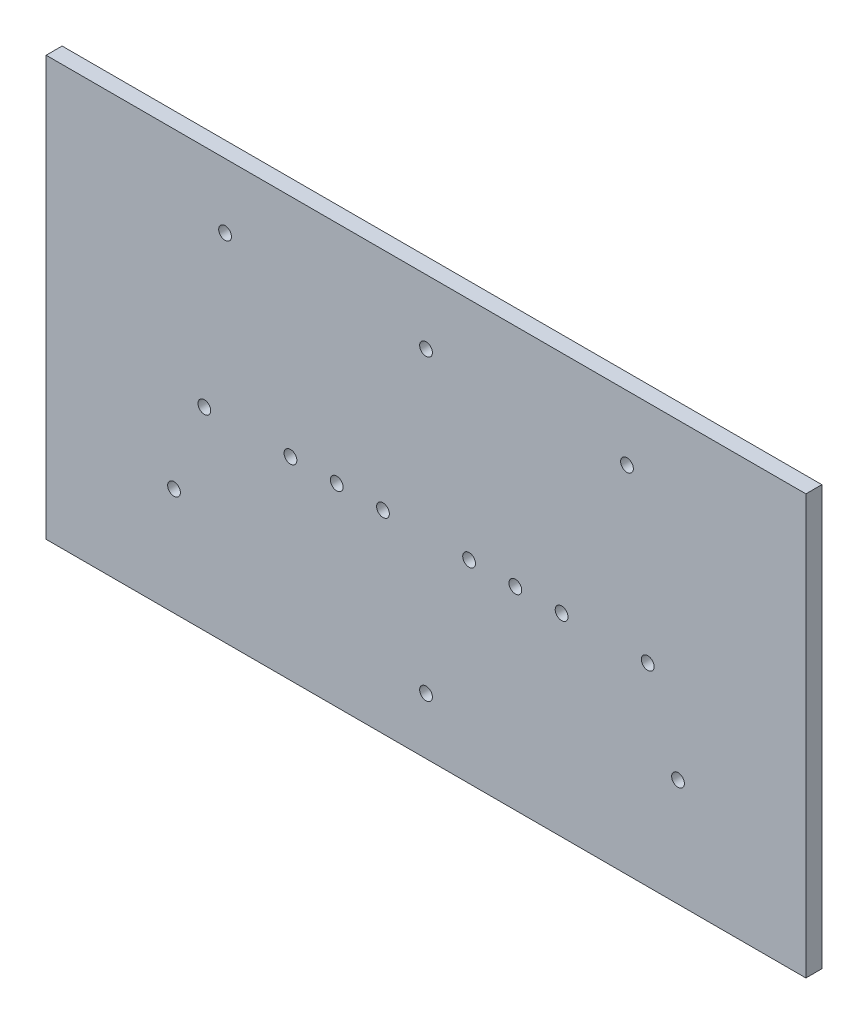
ISO-10303-21;
HEADER;
FILE_DESCRIPTION(('STEP AP214'),'2;1');
FILE_NAME('part.step','',(''),(''),'','','');
FILE_SCHEMA(('AUTOMOTIVE_DESIGN { 1 0 10303 214 1 1 1 1 }'));
ENDSEC;
DATA;
#1=APPLICATION_CONTEXT('core data for automotive mechanical design processes');
#2=APPLICATION_PROTOCOL_DEFINITION('international standard','automotive_design',2000,#1);
#3=PRODUCT_CONTEXT('',#1,'mechanical');
#4=PRODUCT('Part','Part','',(#3));
#5=PRODUCT_RELATED_PRODUCT_CATEGORY('part','',(#4));
#6=PRODUCT_DEFINITION_FORMATION('','',#4);
#7=PRODUCT_DEFINITION_CONTEXT('part definition',#1,'design');
#8=PRODUCT_DEFINITION('design','',#6,#7);
#9=PRODUCT_DEFINITION_SHAPE('','',#8);
#10=(LENGTH_UNIT() NAMED_UNIT(*) SI_UNIT(.MILLI.,.METRE.));
#11=(NAMED_UNIT(*) PLANE_ANGLE_UNIT() SI_UNIT($,.RADIAN.));
#12=(NAMED_UNIT(*) SI_UNIT($,.STERADIAN.) SOLID_ANGLE_UNIT());
#13=UNCERTAINTY_MEASURE_WITH_UNIT(LENGTH_MEASURE(1.E-05),#10,'distance_accuracy_value','');
#14=(GEOMETRIC_REPRESENTATION_CONTEXT(3) GLOBAL_UNCERTAINTY_ASSIGNED_CONTEXT((#13)) GLOBAL_UNIT_ASSIGNED_CONTEXT((#10,
#11,#12)) REPRESENTATION_CONTEXT('',''));
#15=CARTESIAN_POINT('',(0.,0.,0.));
#16=DIRECTION('',(0.,0.,1.));
#17=DIRECTION('',(1.,0.,0.));
#18=AXIS2_PLACEMENT_3D('',#15,#16,#17);
#19=CARTESIAN_POINT('',(0.,0.,0.));
#20=DIRECTION('',(0.,0.,1.));
#21=DIRECTION('',(1.,0.,0.));
#22=AXIS2_PLACEMENT_3D('',#19,#20,#21);
#23=PLANE('',#22);
#24=DIRECTION('',(-1.,0.,0.));
#25=VECTOR('',#24,1.);
#26=CARTESIAN_POINT('',(0.,65.7214488355136,0.));
#27=LINE('',#26,#25);
#28=CARTESIAN_POINT('',(119.089576198768,65.7214488355136,0.));
#29=VERTEX_POINT('',#28);
#30=CARTESIAN_POINT('',(-119.089576198768,65.7214488355136,0.));
#31=VERTEX_POINT('',#30);
#32=EDGE_CURVE('E406',#29,#31,#27,.T.);
#33=ORIENTED_EDGE('',*,*,#32,.F.);
#34=DIRECTION('',(0.,-1.,0.));
#35=VECTOR('',#34,1.);
#36=CARTESIAN_POINT('',(119.089576198768,0.,0.));
#37=LINE('',#36,#35);
#38=CARTESIAN_POINT('',(119.089576198768,-65.7214488355136,0.));
#39=VERTEX_POINT('',#38);
#40=EDGE_CURVE('E314',#29,#39,#37,.T.);
#41=ORIENTED_EDGE('',*,*,#40,.T.);
#42=DIRECTION('',(-1.,0.,0.));
#43=VECTOR('',#42,1.);
#44=CARTESIAN_POINT('',(0.,-65.7214488355136,0.));
#45=LINE('',#44,#43);
#46=CARTESIAN_POINT('',(-119.089576198768,-65.7214488355136,0.));
#47=VERTEX_POINT('',#46);
#48=EDGE_CURVE('E412',#39,#47,#45,.T.);
#49=ORIENTED_EDGE('',*,*,#48,.T.);
#50=DIRECTION('',(0.,-1.,0.));
#51=VECTOR('',#50,1.);
#52=CARTESIAN_POINT('',(-119.089576198768,0.,0.));
#53=LINE('',#52,#51);
#54=EDGE_CURVE('E409',#31,#47,#53,.T.);
#55=ORIENTED_EDGE('',*,*,#54,.F.);
#56=EDGE_LOOP('',(#33,#41,#49,#55));
#57=FACE_BOUND('',#56,.T.);
#58=DIRECTION('',(0.,-1.,0.));
#59=VECTOR('',#58,1.);
#60=CARTESIAN_POINT('',(91.,0.,0.));
#61=LINE('',#60,#59);
#62=CARTESIAN_POINT('',(91.,35.,0.));
#63=VERTEX_POINT('',#62);
#64=CARTESIAN_POINT('',(91.,-35.,0.));
#65=VERTEX_POINT('',#64);
#66=EDGE_CURVE('E257',#63,#65,#61,.T.);
#67=ORIENTED_EDGE('',*,*,#66,.F.);
#68=CARTESIAN_POINT('',(69.,35.,0.));
#69=DIRECTION('',(0.,0.,1.));
#70=DIRECTION('',(1.,0.,0.));
#71=AXIS2_PLACEMENT_3D('',#68,#69,#70);
#72=CIRCLE('',#71,22.);
#73=CARTESIAN_POINT('',(69.,57.,0.));
#74=VERTEX_POINT('',#73);
#75=EDGE_CURVE('E52',#74,#63,#72,.F.);
#76=ORIENTED_EDGE('',*,*,#75,.F.);
#77=DIRECTION('',(-1.,0.,0.));
#78=VECTOR('',#77,1.);
#79=CARTESIAN_POINT('',(0.,57.,0.));
#80=LINE('',#79,#78);
#81=CARTESIAN_POINT('',(-69.,57.,0.));
#82=VERTEX_POINT('',#81);
#83=EDGE_CURVE('E179',#74,#82,#80,.T.);
#84=ORIENTED_EDGE('',*,*,#83,.T.);
#85=CARTESIAN_POINT('',(-69.,35.,0.));
#86=DIRECTION('',(0.,0.,1.));
#87=DIRECTION('',(1.,0.,0.));
#88=AXIS2_PLACEMENT_3D('',#85,#86,#87);
#89=CIRCLE('',#88,22.);
#90=CARTESIAN_POINT('',(-91.,35.,0.));
#91=VERTEX_POINT('',#90);
#92=EDGE_CURVE('E242',#82,#91,#89,.T.);
#93=ORIENTED_EDGE('',*,*,#92,.T.);
#94=DIRECTION('',(0.,-1.,0.));
#95=VECTOR('',#94,1.);
#96=CARTESIAN_POINT('',(-91.,0.,0.));
#97=LINE('',#96,#95);
#98=CARTESIAN_POINT('',(-91.,-35.,0.));
#99=VERTEX_POINT('',#98);
#100=EDGE_CURVE('E245',#91,#99,#97,.T.);
#101=ORIENTED_EDGE('',*,*,#100,.T.);
#102=CARTESIAN_POINT('',(-69.,-35.,0.));
#103=DIRECTION('',(0.,0.,1.));
#104=DIRECTION('',(1.,0.,0.));
#105=AXIS2_PLACEMENT_3D('',#102,#103,#104);
#106=CIRCLE('',#105,22.);
#107=CARTESIAN_POINT('',(-69.,-57.,0.));
#108=VERTEX_POINT('',#107);
#109=EDGE_CURVE('E248',#108,#99,#106,.F.);
#110=ORIENTED_EDGE('',*,*,#109,.F.);
#111=DIRECTION('',(-1.,0.,0.));
#112=VECTOR('',#111,1.);
#113=CARTESIAN_POINT('',(0.,-57.,0.));
#114=LINE('',#113,#112);
#115=CARTESIAN_POINT('',(69.,-57.,0.));
#116=VERTEX_POINT('',#115);
#117=EDGE_CURVE('E251',#116,#108,#114,.T.);
#118=ORIENTED_EDGE('',*,*,#117,.F.);
#119=CARTESIAN_POINT('',(69.,-35.,0.));
#120=DIRECTION('',(0.,0.,1.));
#121=DIRECTION('',(1.,0.,0.));
#122=AXIS2_PLACEMENT_3D('',#119,#120,#121);
#123=CIRCLE('',#122,22.);
#124=EDGE_CURVE('E254',#65,#116,#123,.F.);
#125=ORIENTED_EDGE('',*,*,#124,.F.);
#126=EDGE_LOOP('',(#67,#76,#84,#93,#101,#110,#118,#125));
#127=FACE_BOUND('',#126,.T.);
#128=ADVANCED_FACE('F37',(#57,#127),#23,.F.);
#129=CARTESIAN_POINT('',(-28.,-5.00000000000001,0.));
#130=DIRECTION('',(0.,0.,1.));
#131=DIRECTION('',(1.,0.,0.));
#132=AXIS2_PLACEMENT_3D('',#129,#130,#131);
#133=CIRCLE('',#132,2.);
#134=CARTESIAN_POINT('',(-26.,-5.00000000000001,0.));
#135=VERTEX_POINT('',#134);
#136=EDGE_CURVE('E403',#135,#135,#133,.T.);
#137=ORIENTED_EDGE('',*,*,#136,.T.);
#138=EDGE_LOOP('',(#137));
#139=FACE_BOUND('',#138,.T.);
#140=CARTESIAN_POINT('',(0.,45.500000000002,0.));
#141=DIRECTION('',(0.,0.,1.));
#142=DIRECTION('',(1.,0.,0.));
#143=AXIS2_PLACEMENT_3D('',#140,#141,#142);
#144=CIRCLE('',#143,2.);
#145=CARTESIAN_POINT('',(2.,45.500000000002,0.));
#146=VERTEX_POINT('',#145);
#147=EDGE_CURVE('E400',#146,#146,#144,.T.);
#148=ORIENTED_EDGE('',*,*,#147,.T.);
#149=EDGE_LOOP('',(#148));
#150=FACE_BOUND('',#149,.T.);
#151=CARTESIAN_POINT('',(69.5,-5.00000000000001,0.));
#152=DIRECTION('',(0.,0.,1.));
#153=DIRECTION('',(1.,0.,0.));
#154=AXIS2_PLACEMENT_3D('',#151,#152,#153);
#155=CIRCLE('',#154,2.);
#156=CARTESIAN_POINT('',(71.5,-5.00000000000001,0.));
#157=VERTEX_POINT('',#156);
#158=EDGE_CURVE('E397',#157,#157,#155,.T.);
#159=ORIENTED_EDGE('',*,*,#158,.T.);
#160=EDGE_LOOP('',(#159));
#161=FACE_BOUND('',#160,.T.);
#162=CARTESIAN_POINT('',(42.5,-5.,0.));
#163=DIRECTION('',(0.,0.,1.));
#164=DIRECTION('',(1.,0.,0.));
#165=AXIS2_PLACEMENT_3D('',#162,#163,#164);
#166=CIRCLE('',#165,2.);
#167=CARTESIAN_POINT('',(44.5,-5.,0.));
#168=VERTEX_POINT('',#167);
#169=EDGE_CURVE('E394',#168,#168,#166,.T.);
#170=ORIENTED_EDGE('',*,*,#169,.T.);
#171=EDGE_LOOP('',(#170));
#172=FACE_BOUND('',#171,.T.);
#173=CARTESIAN_POINT('',(28.,-5.00000000000001,0.));
#174=DIRECTION('',(0.,0.,1.));
#175=DIRECTION('',(1.,0.,0.));
#176=AXIS2_PLACEMENT_3D('',#173,#174,#175);
#177=CIRCLE('',#176,2.);
#178=CARTESIAN_POINT('',(30.,-5.00000000000001,0.));
#179=VERTEX_POINT('',#178);
#180=EDGE_CURVE('E391',#179,#179,#177,.T.);
#181=ORIENTED_EDGE('',*,*,#180,.T.);
#182=EDGE_LOOP('',(#181));
#183=FACE_BOUND('',#182,.T.);
#184=CARTESIAN_POINT('',(13.5,-5.00000000000001,0.));
#185=DIRECTION('',(0.,0.,1.));
#186=DIRECTION('',(1.,0.,0.));
#187=AXIS2_PLACEMENT_3D('',#184,#185,#186);
#188=CIRCLE('',#187,2.);
#189=CARTESIAN_POINT('',(15.5,-5.00000000000001,0.));
#190=VERTEX_POINT('',#189);
#191=EDGE_CURVE('E388',#190,#190,#188,.T.);
#192=ORIENTED_EDGE('',*,*,#191,.T.);
#193=EDGE_LOOP('',(#192));
#194=FACE_BOUND('',#193,.T.);
#195=CARTESIAN_POINT('',(-13.5,-5.00000000000001,0.));
#196=DIRECTION('',(0.,0.,1.));
#197=DIRECTION('',(1.,0.,0.));
#198=AXIS2_PLACEMENT_3D('',#195,#196,#197);
#199=CIRCLE('',#198,2.);
#200=CARTESIAN_POINT('',(-11.5,-5.00000000000001,0.));
#201=VERTEX_POINT('',#200);
#202=EDGE_CURVE('E385',#201,#201,#199,.T.);
#203=ORIENTED_EDGE('',*,*,#202,.T.);
#204=EDGE_LOOP('',(#203));
#205=FACE_BOUND('',#204,.T.);
#206=CARTESIAN_POINT('',(-79.,-32.,0.));
#207=DIRECTION('',(0.,0.,1.));
#208=DIRECTION('',(1.,0.,0.));
#209=AXIS2_PLACEMENT_3D('',#206,#207,#208);
#210=CIRCLE('',#209,2.);
#211=CARTESIAN_POINT('',(-77.,-32.,0.));
#212=VERTEX_POINT('',#211);
#213=EDGE_CURVE('E382',#212,#212,#210,.T.);
#214=ORIENTED_EDGE('',*,*,#213,.T.);
#215=EDGE_LOOP('',(#214));
#216=FACE_BOUND('',#215,.T.);
#217=CARTESIAN_POINT('',(-69.5,-5.00000000000001,0.));
#218=DIRECTION('',(0.,0.,1.));
#219=DIRECTION('',(1.,0.,0.));
#220=AXIS2_PLACEMENT_3D('',#217,#218,#219);
#221=CIRCLE('',#220,2.);
#222=CARTESIAN_POINT('',(-67.5,-5.00000000000001,0.));
#223=VERTEX_POINT('',#222);
#224=EDGE_CURVE('E379',#223,#223,#221,.T.);
#225=ORIENTED_EDGE('',*,*,#224,.T.);
#226=EDGE_LOOP('',(#225));
#227=FACE_BOUND('',#226,.T.);
#228=CARTESIAN_POINT('',(-42.5,-5.00000000000001,0.));
#229=DIRECTION('',(0.,0.,1.));
#230=DIRECTION('',(1.,0.,0.));
#231=AXIS2_PLACEMENT_3D('',#228,#229,#230);
#232=CIRCLE('',#231,2.);
#233=CARTESIAN_POINT('',(-40.5,-5.00000000000001,0.));
#234=VERTEX_POINT('',#233);
#235=EDGE_CURVE('E376',#234,#234,#232,.T.);
#236=ORIENTED_EDGE('',*,*,#235,.T.);
#237=EDGE_LOOP('',(#236));
#238=FACE_BOUND('',#237,.T.);
#239=CARTESIAN_POINT('',(-63.,45.5,0.));
#240=DIRECTION('',(0.,0.,1.));
#241=DIRECTION('',(1.,0.,0.));
#242=AXIS2_PLACEMENT_3D('',#239,#240,#241);
#243=CIRCLE('',#242,2.);
#244=CARTESIAN_POINT('',(-61.,45.5,0.));
#245=VERTEX_POINT('',#244);
#246=EDGE_CURVE('E373',#245,#245,#243,.T.);
#247=ORIENTED_EDGE('',*,*,#246,.T.);
#248=EDGE_LOOP('',(#247));
#249=FACE_BOUND('',#248,.T.);
#250=CARTESIAN_POINT('',(63.,45.5,0.));
#251=DIRECTION('',(0.,0.,1.));
#252=DIRECTION('',(1.,0.,0.));
#253=AXIS2_PLACEMENT_3D('',#250,#251,#252);
#254=CIRCLE('',#253,2.);
#255=CARTESIAN_POINT('',(65.,45.5,0.));
#256=VERTEX_POINT('',#255);
#257=EDGE_CURVE('E370',#256,#256,#254,.T.);
#258=ORIENTED_EDGE('',*,*,#257,.T.);
#259=EDGE_LOOP('',(#258));
#260=FACE_BOUND('',#259,.T.);
#261=CARTESIAN_POINT('',(0.,-48.,0.));
#262=DIRECTION('',(0.,0.,1.));
#263=DIRECTION('',(1.,0.,0.));
#264=AXIS2_PLACEMENT_3D('',#261,#262,#263);
#265=CIRCLE('',#264,2.);
#266=CARTESIAN_POINT('',(1.99999999999999,-48.,0.));
#267=VERTEX_POINT('',#266);
#268=EDGE_CURVE('E367',#267,#267,#265,.T.);
#269=ORIENTED_EDGE('',*,*,#268,.T.);
#270=EDGE_LOOP('',(#269));
#271=FACE_BOUND('',#270,.T.);
#272=CARTESIAN_POINT('',(79.,-32.,0.));
#273=DIRECTION('',(0.,0.,1.));
#274=DIRECTION('',(1.,0.,0.));
#275=AXIS2_PLACEMENT_3D('',#272,#273,#274);
#276=CIRCLE('',#275,2.);
#277=CARTESIAN_POINT('',(81.,-32.,0.));
#278=VERTEX_POINT('',#277);
#279=EDGE_CURVE('E297',#278,#278,#276,.T.);
#280=ORIENTED_EDGE('',*,*,#279,.T.);
#281=EDGE_LOOP('',(#280));
#282=FACE_BOUND('',#281,.T.);
#283=CARTESIAN_POINT('',(-69.,35.,0.));
#284=DIRECTION('',(0.,0.,1.));
#285=DIRECTION('',(1.,0.,0.));
#286=AXIS2_PLACEMENT_3D('',#283,#284,#285);
#287=CIRCLE('',#286,20.);
#288=CARTESIAN_POINT('',(-69.,55.,0.));
#289=VERTEX_POINT('',#288);
#290=CARTESIAN_POINT('',(-89.,35.,0.));
#291=VERTEX_POINT('',#290);
#292=EDGE_CURVE('E197',#289,#291,#287,.T.);
#293=ORIENTED_EDGE('',*,*,#292,.F.);
#294=DIRECTION('',(-1.,0.,0.));
#295=VECTOR('',#294,1.);
#296=CARTESIAN_POINT('',(0.,55.,0.));
#297=LINE('',#296,#295);
#298=CARTESIAN_POINT('',(69.,55.,0.));
#299=VERTEX_POINT('',#298);
#300=EDGE_CURVE('E60',#299,#289,#297,.T.);
#301=ORIENTED_EDGE('',*,*,#300,.F.);
#302=CARTESIAN_POINT('',(69.,35.,0.));
#303=DIRECTION('',(0.,0.,1.));
#304=DIRECTION('',(1.,0.,0.));
#305=AXIS2_PLACEMENT_3D('',#302,#303,#304);
#306=CIRCLE('',#305,20.);
#307=CARTESIAN_POINT('',(89.,35.,0.));
#308=VERTEX_POINT('',#307);
#309=EDGE_CURVE('E261',#299,#308,#306,.F.);
#310=ORIENTED_EDGE('',*,*,#309,.T.);
#311=DIRECTION('',(0.,-1.,0.));
#312=VECTOR('',#311,1.);
#313=CARTESIAN_POINT('',(89.,0.,0.));
#314=LINE('',#313,#312);
#315=CARTESIAN_POINT('',(89.,-35.,0.));
#316=VERTEX_POINT('',#315);
#317=EDGE_CURVE('E264',#308,#316,#314,.T.);
#318=ORIENTED_EDGE('',*,*,#317,.T.);
#319=CARTESIAN_POINT('',(69.,-35.,0.));
#320=DIRECTION('',(0.,0.,1.));
#321=DIRECTION('',(1.,0.,0.));
#322=AXIS2_PLACEMENT_3D('',#319,#320,#321);
#323=CIRCLE('',#322,20.);
#324=CARTESIAN_POINT('',(69.,-55.,0.));
#325=VERTEX_POINT('',#324);
#326=EDGE_CURVE('E267',#316,#325,#323,.F.);
#327=ORIENTED_EDGE('',*,*,#326,.T.);
#328=DIRECTION('',(-1.,0.,0.));
#329=VECTOR('',#328,1.);
#330=CARTESIAN_POINT('',(0.,-55.,0.));
#331=LINE('',#330,#329);
#332=CARTESIAN_POINT('',(-69.,-55.,0.));
#333=VERTEX_POINT('',#332);
#334=EDGE_CURVE('E270',#325,#333,#331,.T.);
#335=ORIENTED_EDGE('',*,*,#334,.T.);
#336=CARTESIAN_POINT('',(-69.,-35.,0.));
#337=DIRECTION('',(0.,0.,1.));
#338=DIRECTION('',(1.,0.,0.));
#339=AXIS2_PLACEMENT_3D('',#336,#337,#338);
#340=CIRCLE('',#339,20.);
#341=CARTESIAN_POINT('',(-89.,-35.,0.));
#342=VERTEX_POINT('',#341);
#343=EDGE_CURVE('E273',#333,#342,#340,.F.);
#344=ORIENTED_EDGE('',*,*,#343,.T.);
#345=DIRECTION('',(0.,-1.,0.));
#346=VECTOR('',#345,1.);
#347=CARTESIAN_POINT('',(-89.,0.,0.));
#348=LINE('',#347,#346);
#349=EDGE_CURVE('E200',#291,#342,#348,.T.);
#350=ORIENTED_EDGE('',*,*,#349,.F.);
#351=EDGE_LOOP('',(#293,#301,#310,#318,#327,#335,#344,#350));
#352=FACE_BOUND('',#351,.T.);
#353=ADVANCED_FACE('F440',(#139,#150,#161,#172,#183,#194,#205,#216,#227,#238,#249,#260,#271,
#282,#352),#23,.F.);
#354=CARTESIAN_POINT('',(0.,65.7214488355136,5.));
#355=DIRECTION('',(0.,-1.,0.));
#356=DIRECTION('',(0.,0.,-1.));
#357=AXIS2_PLACEMENT_3D('',#354,#355,#356);
#358=PLANE('',#357);
#359=ORIENTED_EDGE('',*,*,#32,.T.);
#360=DIRECTION('',(0.,0.,-1.));
#361=VECTOR('',#360,1.);
#362=CARTESIAN_POINT('',(-119.089576198768,65.7214488355136,5.));
#363=LINE('',#362,#361);
#364=CARTESIAN_POINT('',(-119.089576198768,65.7214488355136,5.));
#365=VERTEX_POINT('',#364);
#366=EDGE_CURVE('E11',#365,#31,#363,.T.);
#367=ORIENTED_EDGE('',*,*,#366,.F.);
#368=DIRECTION('',(-1.,0.,0.));
#369=VECTOR('',#368,1.);
#370=CARTESIAN_POINT('',(0.,65.7214488355136,5.));
#371=LINE('',#370,#369);
#372=CARTESIAN_POINT('',(119.089576198768,65.7214488355136,5.));
#373=VERTEX_POINT('',#372);
#374=EDGE_CURVE('E353',#373,#365,#371,.T.);
#375=ORIENTED_EDGE('',*,*,#374,.F.);
#376=DIRECTION('',(0.,0.,-1.));
#377=VECTOR('',#376,1.);
#378=CARTESIAN_POINT('',(119.089576198768,65.7214488355136,5.));
#379=LINE('',#378,#377);
#380=EDGE_CURVE('E364',#373,#29,#379,.T.);
#381=ORIENTED_EDGE('',*,*,#380,.T.);
#382=EDGE_LOOP('',(#359,#367,#375,#381));
#383=FACE_BOUND('',#382,.T.);
#384=ADVANCED_FACE('F438',(#383),#358,.F.);
#385=CARTESIAN_POINT('',(-119.089576198768,0.,5.));
#386=DIRECTION('',(1.,0.,0.));
#387=DIRECTION('',(0.,0.,-1.));
#388=AXIS2_PLACEMENT_3D('',#385,#386,#387);
#389=PLANE('',#388);
#390=ORIENTED_EDGE('',*,*,#54,.T.);
#391=DIRECTION('',(0.,0.,-1.));
#392=VECTOR('',#391,1.);
#393=CARTESIAN_POINT('',(-119.089576198768,-65.7214488355136,5.));
#394=LINE('',#393,#392);
#395=CARTESIAN_POINT('',(-119.089576198768,-65.7214488355136,5.));
#396=VERTEX_POINT('',#395);
#397=EDGE_CURVE('E45',#396,#47,#394,.T.);
#398=ORIENTED_EDGE('',*,*,#397,.F.);
#399=DIRECTION('',(0.,-1.,0.));
#400=VECTOR('',#399,1.);
#401=CARTESIAN_POINT('',(-119.089576198768,0.,5.));
#402=LINE('',#401,#400);
#403=EDGE_CURVE('E356',#365,#396,#402,.T.);
#404=ORIENTED_EDGE('',*,*,#403,.F.);
#405=ORIENTED_EDGE('',*,*,#366,.T.);
#406=EDGE_LOOP('',(#390,#398,#404,#405));
#407=FACE_BOUND('',#406,.T.);
#408=ADVANCED_FACE('F425',(#407),#389,.F.);
#409=CARTESIAN_POINT('',(0.,-65.7214488355136,5.));
#410=DIRECTION('',(0.,-1.,0.));
#411=DIRECTION('',(0.,0.,-1.));
#412=AXIS2_PLACEMENT_3D('',#409,#410,#411);
#413=PLANE('',#412);
#414=ORIENTED_EDGE('',*,*,#48,.F.);
#415=DIRECTION('',(0.,0.,-1.));
#416=VECTOR('',#415,1.);
#417=CARTESIAN_POINT('',(119.089576198768,-65.7214488355136,5.));
#418=LINE('',#417,#416);
#419=CARTESIAN_POINT('',(119.089576198768,-65.7214488355136,5.));
#420=VERTEX_POINT('',#419);
#421=EDGE_CURVE('E418',#420,#39,#418,.T.);
#422=ORIENTED_EDGE('',*,*,#421,.F.);
#423=DIRECTION('',(-1.,0.,0.));
#424=VECTOR('',#423,1.);
#425=CARTESIAN_POINT('',(0.,-65.7214488355136,5.));
#426=LINE('',#425,#424);
#427=EDGE_CURVE('E358',#420,#396,#426,.T.);
#428=ORIENTED_EDGE('',*,*,#427,.T.);
#429=ORIENTED_EDGE('',*,*,#397,.T.);
#430=EDGE_LOOP('',(#414,#422,#428,#429));
#431=FACE_BOUND('',#430,.T.);
#432=ADVANCED_FACE('F422',(#431),#413,.T.);
#433=CARTESIAN_POINT('',(-28.,-5.00000000000001,5.));
#434=DIRECTION('',(0.,0.,-1.));
#435=DIRECTION('',(-1.,0.,0.));
#436=AXIS2_PLACEMENT_3D('',#433,#434,#435);
#437=CYLINDRICAL_SURFACE('',#436,2.);
#438=CARTESIAN_POINT('',(-28.,-5.00000000000001,5.));
#439=DIRECTION('',(0.,0.,1.));
#440=DIRECTION('',(1.,0.,0.));
#441=AXIS2_PLACEMENT_3D('',#438,#439,#440);
#442=CIRCLE('',#441,2.);
#443=CARTESIAN_POINT('',(-26.,-5.00000000000001,5.));
#444=VERTEX_POINT('',#443);
#445=EDGE_CURVE('E350',#444,#444,#442,.T.);
#446=ORIENTED_EDGE('',*,*,#445,.T.);
#447=EDGE_LOOP('',(#446));
#448=FACE_BOUND('',#447,.T.);
#449=ORIENTED_EDGE('',*,*,#136,.F.);
#450=EDGE_LOOP('',(#449));
#451=FACE_BOUND('',#450,.T.);
#452=ADVANCED_FACE('F459',(#448,#451),#437,.F.);
#453=CARTESIAN_POINT('',(0.,45.500000000002,5.));
#454=DIRECTION('',(0.,0.,-1.));
#455=DIRECTION('',(-1.,0.,0.));
#456=AXIS2_PLACEMENT_3D('',#453,#454,#455);
#457=CYLINDRICAL_SURFACE('',#456,2.);
#458=CARTESIAN_POINT('',(0.,45.500000000002,5.));
#459=DIRECTION('',(0.,0.,1.));
#460=DIRECTION('',(1.,0.,0.));
#461=AXIS2_PLACEMENT_3D('',#458,#459,#460);
#462=CIRCLE('',#461,2.);
#463=CARTESIAN_POINT('',(2.,45.500000000002,5.));
#464=VERTEX_POINT('',#463);
#465=EDGE_CURVE('E347',#464,#464,#462,.T.);
#466=ORIENTED_EDGE('',*,*,#465,.T.);
#467=EDGE_LOOP('',(#466));
#468=FACE_BOUND('',#467,.T.);
#469=ORIENTED_EDGE('',*,*,#147,.F.);
#470=EDGE_LOOP('',(#469));
#471=FACE_BOUND('',#470,.T.);
#472=ADVANCED_FACE('F463',(#468,#471),#457,.F.);
#473=CARTESIAN_POINT('',(69.5,-5.00000000000001,5.));
#474=DIRECTION('',(0.,0.,-1.));
#475=DIRECTION('',(-1.,0.,0.));
#476=AXIS2_PLACEMENT_3D('',#473,#474,#475);
#477=CYLINDRICAL_SURFACE('',#476,2.);
#478=CARTESIAN_POINT('',(69.5,-5.00000000000001,5.));
#479=DIRECTION('',(0.,0.,1.));
#480=DIRECTION('',(1.,0.,0.));
#481=AXIS2_PLACEMENT_3D('',#478,#479,#480);
#482=CIRCLE('',#481,2.);
#483=CARTESIAN_POINT('',(71.5,-5.00000000000001,5.));
#484=VERTEX_POINT('',#483);
#485=EDGE_CURVE('E344',#484,#484,#482,.T.);
#486=ORIENTED_EDGE('',*,*,#485,.T.);
#487=EDGE_LOOP('',(#486));
#488=FACE_BOUND('',#487,.T.);
#489=ORIENTED_EDGE('',*,*,#158,.F.);
#490=EDGE_LOOP('',(#489));
#491=FACE_BOUND('',#490,.T.);
#492=ADVANCED_FACE('F468',(#488,#491),#477,.F.);
#493=CARTESIAN_POINT('',(42.5,-5.,5.));
#494=DIRECTION('',(0.,0.,-1.));
#495=DIRECTION('',(-1.,0.,0.));
#496=AXIS2_PLACEMENT_3D('',#493,#494,#495);
#497=CYLINDRICAL_SURFACE('',#496,2.);
#498=CARTESIAN_POINT('',(42.5,-5.,5.));
#499=DIRECTION('',(0.,0.,1.));
#500=DIRECTION('',(1.,0.,0.));
#501=AXIS2_PLACEMENT_3D('',#498,#499,#500);
#502=CIRCLE('',#501,2.);
#503=CARTESIAN_POINT('',(44.5,-5.,5.));
#504=VERTEX_POINT('',#503);
#505=EDGE_CURVE('E341',#504,#504,#502,.T.);
#506=ORIENTED_EDGE('',*,*,#505,.T.);
#507=EDGE_LOOP('',(#506));
#508=FACE_BOUND('',#507,.T.);
#509=ORIENTED_EDGE('',*,*,#169,.F.);
#510=EDGE_LOOP('',(#509));
#511=FACE_BOUND('',#510,.T.);
#512=ADVANCED_FACE('F475',(#508,#511),#497,.F.);
#513=CARTESIAN_POINT('',(28.,-5.00000000000001,5.));
#514=DIRECTION('',(0.,0.,-1.));
#515=DIRECTION('',(-1.,0.,0.));
#516=AXIS2_PLACEMENT_3D('',#513,#514,#515);
#517=CYLINDRICAL_SURFACE('',#516,2.);
#518=CARTESIAN_POINT('',(28.,-5.00000000000001,5.));
#519=DIRECTION('',(0.,0.,1.));
#520=DIRECTION('',(1.,0.,0.));
#521=AXIS2_PLACEMENT_3D('',#518,#519,#520);
#522=CIRCLE('',#521,2.);
#523=CARTESIAN_POINT('',(30.,-5.00000000000001,5.));
#524=VERTEX_POINT('',#523);
#525=EDGE_CURVE('E338',#524,#524,#522,.T.);
#526=ORIENTED_EDGE('',*,*,#525,.T.);
#527=EDGE_LOOP('',(#526));
#528=FACE_BOUND('',#527,.T.);
#529=ORIENTED_EDGE('',*,*,#180,.F.);
#530=EDGE_LOOP('',(#529));
#531=FACE_BOUND('',#530,.T.);
#532=ADVANCED_FACE('F479',(#528,#531),#517,.F.);
#533=CARTESIAN_POINT('',(13.5,-5.00000000000001,5.));
#534=DIRECTION('',(0.,0.,-1.));
#535=DIRECTION('',(-1.,0.,0.));
#536=AXIS2_PLACEMENT_3D('',#533,#534,#535);
#537=CYLINDRICAL_SURFACE('',#536,2.);
#538=CARTESIAN_POINT('',(13.5,-5.00000000000001,5.));
#539=DIRECTION('',(0.,0.,1.));
#540=DIRECTION('',(1.,0.,0.));
#541=AXIS2_PLACEMENT_3D('',#538,#539,#540);
#542=CIRCLE('',#541,2.);
#543=CARTESIAN_POINT('',(15.5,-5.00000000000001,5.));
#544=VERTEX_POINT('',#543);
#545=EDGE_CURVE('E335',#544,#544,#542,.T.);
#546=ORIENTED_EDGE('',*,*,#545,.T.);
#547=EDGE_LOOP('',(#546));
#548=FACE_BOUND('',#547,.T.);
#549=ORIENTED_EDGE('',*,*,#191,.F.);
#550=EDGE_LOOP('',(#549));
#551=FACE_BOUND('',#550,.T.);
#552=ADVANCED_FACE('F483',(#548,#551),#537,.F.);
#553=CARTESIAN_POINT('',(-13.5,-5.00000000000001,5.));
#554=DIRECTION('',(0.,0.,-1.));
#555=DIRECTION('',(-1.,0.,0.));
#556=AXIS2_PLACEMENT_3D('',#553,#554,#555);
#557=CYLINDRICAL_SURFACE('',#556,2.);
#558=CARTESIAN_POINT('',(-13.5,-5.00000000000001,5.));
#559=DIRECTION('',(0.,0.,1.));
#560=DIRECTION('',(1.,0.,0.));
#561=AXIS2_PLACEMENT_3D('',#558,#559,#560);
#562=CIRCLE('',#561,2.);
#563=CARTESIAN_POINT('',(-11.5,-5.00000000000001,5.));
#564=VERTEX_POINT('',#563);
#565=EDGE_CURVE('E332',#564,#564,#562,.T.);
#566=ORIENTED_EDGE('',*,*,#565,.T.);
#567=EDGE_LOOP('',(#566));
#568=FACE_BOUND('',#567,.T.);
#569=ORIENTED_EDGE('',*,*,#202,.F.);
#570=EDGE_LOOP('',(#569));
#571=FACE_BOUND('',#570,.T.);
#572=ADVANCED_FACE('F487',(#568,#571),#557,.F.);
#573=CARTESIAN_POINT('',(-79.,-32.,5.));
#574=DIRECTION('',(0.,0.,-1.));
#575=DIRECTION('',(-1.,0.,0.));
#576=AXIS2_PLACEMENT_3D('',#573,#574,#575);
#577=CYLINDRICAL_SURFACE('',#576,2.);
#578=CARTESIAN_POINT('',(-79.,-32.,5.));
#579=DIRECTION('',(0.,0.,1.));
#580=DIRECTION('',(1.,0.,0.));
#581=AXIS2_PLACEMENT_3D('',#578,#579,#580);
#582=CIRCLE('',#581,2.);
#583=CARTESIAN_POINT('',(-77.,-32.,5.));
#584=VERTEX_POINT('',#583);
#585=EDGE_CURVE('E329',#584,#584,#582,.T.);
#586=ORIENTED_EDGE('',*,*,#585,.T.);
#587=EDGE_LOOP('',(#586));
#588=FACE_BOUND('',#587,.T.);
#589=ORIENTED_EDGE('',*,*,#213,.F.);
#590=EDGE_LOOP('',(#589));
#591=FACE_BOUND('',#590,.T.);
#592=ADVANCED_FACE('F491',(#588,#591),#577,.F.);
#593=CARTESIAN_POINT('',(-69.5,-5.00000000000001,5.));
#594=DIRECTION('',(0.,0.,-1.));
#595=DIRECTION('',(-1.,0.,0.));
#596=AXIS2_PLACEMENT_3D('',#593,#594,#595);
#597=CYLINDRICAL_SURFACE('',#596,2.);
#598=CARTESIAN_POINT('',(-69.5,-5.00000000000001,5.));
#599=DIRECTION('',(0.,0.,1.));
#600=DIRECTION('',(1.,0.,0.));
#601=AXIS2_PLACEMENT_3D('',#598,#599,#600);
#602=CIRCLE('',#601,2.);
#603=CARTESIAN_POINT('',(-67.5,-5.00000000000001,5.));
#604=VERTEX_POINT('',#603);
#605=EDGE_CURVE('E326',#604,#604,#602,.T.);
#606=ORIENTED_EDGE('',*,*,#605,.T.);
#607=EDGE_LOOP('',(#606));
#608=FACE_BOUND('',#607,.T.);
#609=ORIENTED_EDGE('',*,*,#224,.F.);
#610=EDGE_LOOP('',(#609));
#611=FACE_BOUND('',#610,.T.);
#612=ADVANCED_FACE('F495',(#608,#611),#597,.F.);
#613=CARTESIAN_POINT('',(-42.5,-5.00000000000001,5.));
#614=DIRECTION('',(0.,0.,-1.));
#615=DIRECTION('',(-1.,0.,0.));
#616=AXIS2_PLACEMENT_3D('',#613,#614,#615);
#617=CYLINDRICAL_SURFACE('',#616,2.);
#618=CARTESIAN_POINT('',(-42.5,-5.00000000000001,5.));
#619=DIRECTION('',(0.,0.,1.));
#620=DIRECTION('',(1.,0.,0.));
#621=AXIS2_PLACEMENT_3D('',#618,#619,#620);
#622=CIRCLE('',#621,2.);
#623=CARTESIAN_POINT('',(-40.5,-5.00000000000001,5.));
#624=VERTEX_POINT('',#623);
#625=EDGE_CURVE('E323',#624,#624,#622,.T.);
#626=ORIENTED_EDGE('',*,*,#625,.T.);
#627=EDGE_LOOP('',(#626));
#628=FACE_BOUND('',#627,.T.);
#629=ORIENTED_EDGE('',*,*,#235,.F.);
#630=EDGE_LOOP('',(#629));
#631=FACE_BOUND('',#630,.T.);
#632=ADVANCED_FACE('F499',(#628,#631),#617,.F.);
#633=CARTESIAN_POINT('',(-63.,45.5,5.));
#634=DIRECTION('',(0.,0.,-1.));
#635=DIRECTION('',(-1.,0.,0.));
#636=AXIS2_PLACEMENT_3D('',#633,#634,#635);
#637=CYLINDRICAL_SURFACE('',#636,2.);
#638=CARTESIAN_POINT('',(-63.,45.5,5.));
#639=DIRECTION('',(0.,0.,1.));
#640=DIRECTION('',(1.,0.,0.));
#641=AXIS2_PLACEMENT_3D('',#638,#639,#640);
#642=CIRCLE('',#641,2.);
#643=CARTESIAN_POINT('',(-61.,45.5,5.));
#644=VERTEX_POINT('',#643);
#645=EDGE_CURVE('E320',#644,#644,#642,.T.);
#646=ORIENTED_EDGE('',*,*,#645,.T.);
#647=EDGE_LOOP('',(#646));
#648=FACE_BOUND('',#647,.T.);
#649=ORIENTED_EDGE('',*,*,#246,.F.);
#650=EDGE_LOOP('',(#649));
#651=FACE_BOUND('',#650,.T.);
#652=ADVANCED_FACE('F503',(#648,#651),#637,.F.);
#653=CARTESIAN_POINT('',(63.,45.5,5.));
#654=DIRECTION('',(0.,0.,-1.));
#655=DIRECTION('',(-1.,0.,0.));
#656=AXIS2_PLACEMENT_3D('',#653,#654,#655);
#657=CYLINDRICAL_SURFACE('',#656,2.);
#658=CARTESIAN_POINT('',(63.,45.5,5.));
#659=DIRECTION('',(0.,0.,1.));
#660=DIRECTION('',(1.,0.,0.));
#661=AXIS2_PLACEMENT_3D('',#658,#659,#660);
#662=CIRCLE('',#661,2.);
#663=CARTESIAN_POINT('',(65.,45.5,5.));
#664=VERTEX_POINT('',#663);
#665=EDGE_CURVE('E317',#664,#664,#662,.T.);
#666=ORIENTED_EDGE('',*,*,#665,.T.);
#667=EDGE_LOOP('',(#666));
#668=FACE_BOUND('',#667,.T.);
#669=ORIENTED_EDGE('',*,*,#257,.F.);
#670=EDGE_LOOP('',(#669));
#671=FACE_BOUND('',#670,.T.);
#672=ADVANCED_FACE('F507',(#668,#671),#657,.F.);
#673=CARTESIAN_POINT('',(0.,-48.,5.));
#674=DIRECTION('',(0.,0.,-1.));
#675=DIRECTION('',(-1.,0.,0.));
#676=AXIS2_PLACEMENT_3D('',#673,#674,#675);
#677=CYLINDRICAL_SURFACE('',#676,2.);
#678=CARTESIAN_POINT('',(0.,-48.,5.));
#679=DIRECTION('',(0.,0.,1.));
#680=DIRECTION('',(1.,0.,0.));
#681=AXIS2_PLACEMENT_3D('',#678,#679,#680);
#682=CIRCLE('',#681,2.);
#683=CARTESIAN_POINT('',(1.99999999999999,-48.,5.));
#684=VERTEX_POINT('',#683);
#685=EDGE_CURVE('E313',#684,#684,#682,.T.);
#686=ORIENTED_EDGE('',*,*,#685,.T.);
#687=EDGE_LOOP('',(#686));
#688=FACE_BOUND('',#687,.T.);
#689=ORIENTED_EDGE('',*,*,#268,.F.);
#690=EDGE_LOOP('',(#689));
#691=FACE_BOUND('',#690,.T.);
#692=ADVANCED_FACE('F510',(#688,#691),#677,.F.);
#693=CARTESIAN_POINT('',(79.,-32.,5.));
#694=DIRECTION('',(0.,0.,-1.));
#695=DIRECTION('',(-1.,0.,0.));
#696=AXIS2_PLACEMENT_3D('',#693,#694,#695);
#697=CYLINDRICAL_SURFACE('',#696,2.);
#698=CARTESIAN_POINT('',(79.,-32.,5.));
#699=DIRECTION('',(0.,0.,1.));
#700=DIRECTION('',(1.,0.,0.));
#701=AXIS2_PLACEMENT_3D('',#698,#699,#700);
#702=CIRCLE('',#701,2.);
#703=CARTESIAN_POINT('',(81.,-32.,5.));
#704=VERTEX_POINT('',#703);
#705=EDGE_CURVE('E310',#704,#704,#702,.T.);
#706=ORIENTED_EDGE('',*,*,#705,.T.);
#707=EDGE_LOOP('',(#706));
#708=FACE_BOUND('',#707,.T.);
#709=ORIENTED_EDGE('',*,*,#279,.F.);
#710=EDGE_LOOP('',(#709));
#711=FACE_BOUND('',#710,.T.);
#712=ADVANCED_FACE('F39',(#708,#711),#697,.F.);
#713=CARTESIAN_POINT('',(119.089576198768,0.,5.));
#714=DIRECTION('',(1.,0.,0.));
#715=DIRECTION('',(0.,0.,-1.));
#716=AXIS2_PLACEMENT_3D('',#713,#714,#715);
#717=PLANE('',#716);
#718=ORIENTED_EDGE('',*,*,#40,.F.);
#719=ORIENTED_EDGE('',*,*,#380,.F.);
#720=DIRECTION('',(0.,-1.,0.));
#721=VECTOR('',#720,1.);
#722=CARTESIAN_POINT('',(119.089576198768,0.,5.));
#723=LINE('',#722,#721);
#724=EDGE_CURVE('E361',#373,#420,#723,.T.);
#725=ORIENTED_EDGE('',*,*,#724,.T.);
#726=ORIENTED_EDGE('',*,*,#421,.T.);
#727=EDGE_LOOP('',(#718,#719,#725,#726));
#728=FACE_BOUND('',#727,.T.);
#729=ADVANCED_FACE('F432',(#728),#717,.T.);
#730=CARTESIAN_POINT('',(0.,0.,5.));
#731=DIRECTION('',(0.,0.,1.));
#732=DIRECTION('',(1.,0.,0.));
#733=AXIS2_PLACEMENT_3D('',#730,#731,#732);
#734=PLANE('',#733);
#735=ORIENTED_EDGE('',*,*,#705,.F.);
#736=EDGE_LOOP('',(#735));
#737=FACE_BOUND('',#736,.T.);
#738=ORIENTED_EDGE('',*,*,#685,.F.);
#739=EDGE_LOOP('',(#738));
#740=FACE_BOUND('',#739,.T.);
#741=ORIENTED_EDGE('',*,*,#665,.F.);
#742=EDGE_LOOP('',(#741));
#743=FACE_BOUND('',#742,.T.);
#744=ORIENTED_EDGE('',*,*,#645,.F.);
#745=EDGE_LOOP('',(#744));
#746=FACE_BOUND('',#745,.T.);
#747=ORIENTED_EDGE('',*,*,#625,.F.);
#748=EDGE_LOOP('',(#747));
#749=FACE_BOUND('',#748,.T.);
#750=ORIENTED_EDGE('',*,*,#605,.F.);
#751=EDGE_LOOP('',(#750));
#752=FACE_BOUND('',#751,.T.);
#753=ORIENTED_EDGE('',*,*,#585,.F.);
#754=EDGE_LOOP('',(#753));
#755=FACE_BOUND('',#754,.T.);
#756=ORIENTED_EDGE('',*,*,#565,.F.);
#757=EDGE_LOOP('',(#756));
#758=FACE_BOUND('',#757,.T.);
#759=ORIENTED_EDGE('',*,*,#545,.F.);
#760=EDGE_LOOP('',(#759));
#761=FACE_BOUND('',#760,.T.);
#762=ORIENTED_EDGE('',*,*,#525,.F.);
#763=EDGE_LOOP('',(#762));
#764=FACE_BOUND('',#763,.T.);
#765=ORIENTED_EDGE('',*,*,#505,.F.);
#766=EDGE_LOOP('',(#765));
#767=FACE_BOUND('',#766,.T.);
#768=ORIENTED_EDGE('',*,*,#485,.F.);
#769=EDGE_LOOP('',(#768));
#770=FACE_BOUND('',#769,.T.);
#771=ORIENTED_EDGE('',*,*,#465,.F.);
#772=EDGE_LOOP('',(#771));
#773=FACE_BOUND('',#772,.T.);
#774=ORIENTED_EDGE('',*,*,#445,.F.);
#775=EDGE_LOOP('',(#774));
#776=FACE_BOUND('',#775,.T.);
#777=ORIENTED_EDGE('',*,*,#374,.T.);
#778=ORIENTED_EDGE('',*,*,#403,.T.);
#779=ORIENTED_EDGE('',*,*,#427,.F.);
#780=ORIENTED_EDGE('',*,*,#724,.F.);
#781=EDGE_LOOP('',(#777,#778,#779,#780));
#782=FACE_BOUND('',#781,.T.);
#783=ADVANCED_FACE('F436',(#737,#740,#743,#746,#749,#752,#755,#758,#761,#764,#767,#770,#773,
#776,#782),#734,.T.);
#784=CARTESIAN_POINT('',(0.,55.,1.));
#785=DIRECTION('',(0.,-1.,0.));
#786=DIRECTION('',(0.,0.,-1.));
#787=AXIS2_PLACEMENT_3D('',#784,#785,#786);
#788=PLANE('',#787);
#789=ORIENTED_EDGE('',*,*,#300,.T.);
#790=DIRECTION('',(0.,0.,-1.));
#791=VECTOR('',#790,1.);
#792=CARTESIAN_POINT('',(-69.,55.,1.));
#793=LINE('',#792,#791);
#794=CARTESIAN_POINT('',(-69.,55.,1.));
#795=VERTEX_POINT('',#794);
#796=EDGE_CURVE('E181',#795,#289,#793,.T.);
#797=ORIENTED_EDGE('',*,*,#796,.F.);
#798=DIRECTION('',(-1.,0.,0.));
#799=VECTOR('',#798,1.);
#800=CARTESIAN_POINT('',(0.,55.,1.));
#801=LINE('',#800,#799);
#802=CARTESIAN_POINT('',(69.,55.,1.));
#803=VERTEX_POINT('',#802);
#804=EDGE_CURVE('E217',#803,#795,#801,.T.);
#805=ORIENTED_EDGE('',*,*,#804,.F.);
#806=DIRECTION('',(0.,0.,-1.));
#807=VECTOR('',#806,1.);
#808=CARTESIAN_POINT('',(69.,55.,1.));
#809=LINE('',#808,#807);
#810=EDGE_CURVE('E295',#803,#299,#809,.T.);
#811=ORIENTED_EDGE('',*,*,#810,.T.);
#812=EDGE_LOOP('',(#789,#797,#805,#811));
#813=FACE_BOUND('',#812,.T.);
#814=ADVANCED_FACE('F532',(#813),#788,.F.);
#815=CARTESIAN_POINT('',(69.,35.,1.));
#816=DIRECTION('',(0.,0.,-1.));
#817=DIRECTION('',(-1.,0.,0.));
#818=AXIS2_PLACEMENT_3D('',#815,#816,#817);
#819=CYLINDRICAL_SURFACE('',#818,20.);
#820=ORIENTED_EDGE('',*,*,#309,.F.);
#821=ORIENTED_EDGE('',*,*,#810,.F.);
#822=CARTESIAN_POINT('',(69.,35.,1.));
#823=DIRECTION('',(0.,0.,1.));
#824=DIRECTION('',(1.,0.,0.));
#825=AXIS2_PLACEMENT_3D('',#822,#823,#824);
#826=CIRCLE('',#825,20.);
#827=CARTESIAN_POINT('',(89.,35.,1.));
#828=VERTEX_POINT('',#827);
#829=EDGE_CURVE('E220',#803,#828,#826,.F.);
#830=ORIENTED_EDGE('',*,*,#829,.T.);
#831=DIRECTION('',(0.,0.,-1.));
#832=VECTOR('',#831,1.);
#833=CARTESIAN_POINT('',(89.,35.,1.));
#834=LINE('',#833,#832);
#835=EDGE_CURVE('E292',#828,#308,#834,.T.);
#836=ORIENTED_EDGE('',*,*,#835,.T.);
#837=EDGE_LOOP('',(#820,#821,#830,#836));
#838=FACE_BOUND('',#837,.T.);
#839=ADVANCED_FACE('F537',(#838),#819,.T.);
#840=CARTESIAN_POINT('',(89.,0.,1.));
#841=DIRECTION('',(1.,0.,0.));
#842=DIRECTION('',(0.,0.,-1.));
#843=AXIS2_PLACEMENT_3D('',#840,#841,#842);
#844=PLANE('',#843);
#845=ORIENTED_EDGE('',*,*,#317,.F.);
#846=ORIENTED_EDGE('',*,*,#835,.F.);
#847=DIRECTION('',(0.,-1.,0.));
#848=VECTOR('',#847,1.);
#849=CARTESIAN_POINT('',(89.,0.,1.));
#850=LINE('',#849,#848);
#851=CARTESIAN_POINT('',(89.,-35.,1.));
#852=VERTEX_POINT('',#851);
#853=EDGE_CURVE('E223',#828,#852,#850,.T.);
#854=ORIENTED_EDGE('',*,*,#853,.T.);
#855=DIRECTION('',(0.,0.,-1.));
#856=VECTOR('',#855,1.);
#857=CARTESIAN_POINT('',(89.,-35.,1.));
#858=LINE('',#857,#856);
#859=EDGE_CURVE('E289',#852,#316,#858,.T.);
#860=ORIENTED_EDGE('',*,*,#859,.T.);
#861=EDGE_LOOP('',(#845,#846,#854,#860));
#862=FACE_BOUND('',#861,.T.);
#863=ADVANCED_FACE('F539',(#862),#844,.T.);
#864=CARTESIAN_POINT('',(69.,-35.,1.));
#865=DIRECTION('',(0.,0.,-1.));
#866=DIRECTION('',(-1.,0.,0.));
#867=AXIS2_PLACEMENT_3D('',#864,#865,#866);
#868=CYLINDRICAL_SURFACE('',#867,20.);
#869=ORIENTED_EDGE('',*,*,#326,.F.);
#870=ORIENTED_EDGE('',*,*,#859,.F.);
#871=CARTESIAN_POINT('',(69.,-35.,1.));
#872=DIRECTION('',(0.,0.,1.));
#873=DIRECTION('',(1.,0.,0.));
#874=AXIS2_PLACEMENT_3D('',#871,#872,#873);
#875=CIRCLE('',#874,20.);
#876=CARTESIAN_POINT('',(69.,-55.,1.));
#877=VERTEX_POINT('',#876);
#878=EDGE_CURVE('E226',#852,#877,#875,.F.);
#879=ORIENTED_EDGE('',*,*,#878,.T.);
#880=DIRECTION('',(0.,0.,-1.));
#881=VECTOR('',#880,1.);
#882=CARTESIAN_POINT('',(69.,-55.,1.));
#883=LINE('',#882,#881);
#884=EDGE_CURVE('E286',#877,#325,#883,.T.);
#885=ORIENTED_EDGE('',*,*,#884,.T.);
#886=EDGE_LOOP('',(#869,#870,#879,#885));
#887=FACE_BOUND('',#886,.T.);
#888=ADVANCED_FACE('F542',(#887),#868,.T.);
#889=CARTESIAN_POINT('',(0.,-55.,1.));
#890=DIRECTION('',(0.,-1.,0.));
#891=DIRECTION('',(0.,0.,-1.));
#892=AXIS2_PLACEMENT_3D('',#889,#890,#891);
#893=PLANE('',#892);
#894=ORIENTED_EDGE('',*,*,#334,.F.);
#895=ORIENTED_EDGE('',*,*,#884,.F.);
#896=DIRECTION('',(-1.,0.,0.));
#897=VECTOR('',#896,1.);
#898=CARTESIAN_POINT('',(0.,-55.,1.));
#899=LINE('',#898,#897);
#900=CARTESIAN_POINT('',(-69.,-55.,1.));
#901=VERTEX_POINT('',#900);
#902=EDGE_CURVE('E229',#877,#901,#899,.T.);
#903=ORIENTED_EDGE('',*,*,#902,.T.);
#904=DIRECTION('',(0.,0.,-1.));
#905=VECTOR('',#904,1.);
#906=CARTESIAN_POINT('',(-69.,-55.,1.));
#907=LINE('',#906,#905);
#908=EDGE_CURVE('E283',#901,#333,#907,.T.);
#909=ORIENTED_EDGE('',*,*,#908,.T.);
#910=EDGE_LOOP('',(#894,#895,#903,#909));
#911=FACE_BOUND('',#910,.T.);
#912=ADVANCED_FACE('F545',(#911),#893,.T.);
#913=CARTESIAN_POINT('',(-69.,-35.,1.));
#914=DIRECTION('',(0.,0.,-1.));
#915=DIRECTION('',(-1.,0.,0.));
#916=AXIS2_PLACEMENT_3D('',#913,#914,#915);
#917=CYLINDRICAL_SURFACE('',#916,20.);
#918=ORIENTED_EDGE('',*,*,#343,.F.);
#919=ORIENTED_EDGE('',*,*,#908,.F.);
#920=CARTESIAN_POINT('',(-69.,-35.,1.));
#921=DIRECTION('',(0.,0.,1.));
#922=DIRECTION('',(1.,0.,0.));
#923=AXIS2_PLACEMENT_3D('',#920,#921,#922);
#924=CIRCLE('',#923,20.);
#925=CARTESIAN_POINT('',(-89.,-35.,1.));
#926=VERTEX_POINT('',#925);
#927=EDGE_CURVE('E232',#901,#926,#924,.F.);
#928=ORIENTED_EDGE('',*,*,#927,.T.);
#929=DIRECTION('',(0.,0.,-1.));
#930=VECTOR('',#929,1.);
#931=CARTESIAN_POINT('',(-89.,-35.,1.));
#932=LINE('',#931,#930);
#933=EDGE_CURVE('E281',#926,#342,#932,.T.);
#934=ORIENTED_EDGE('',*,*,#933,.T.);
#935=EDGE_LOOP('',(#918,#919,#928,#934));
#936=FACE_BOUND('',#935,.T.);
#937=ADVANCED_FACE('F548',(#936),#917,.T.);
#938=CARTESIAN_POINT('',(-89.,0.,1.));
#939=DIRECTION('',(1.,0.,0.));
#940=DIRECTION('',(0.,1.,0.));
#941=AXIS2_PLACEMENT_3D('',#938,#939,#940);
#942=PLANE('',#941);
#943=ORIENTED_EDGE('',*,*,#349,.T.);
#944=ORIENTED_EDGE('',*,*,#933,.F.);
#945=DIRECTION('',(0.,-1.,0.));
#946=VECTOR('',#945,1.);
#947=CARTESIAN_POINT('',(-89.,0.,1.));
#948=LINE('',#947,#946);
#949=CARTESIAN_POINT('',(-89.,35.,1.));
#950=VERTEX_POINT('',#949);
#951=EDGE_CURVE('E234',#950,#926,#948,.T.);
#952=ORIENTED_EDGE('',*,*,#951,.F.);
#953=DIRECTION('',(0.,0.,-1.));
#954=VECTOR('',#953,1.);
#955=CARTESIAN_POINT('',(-89.,35.,1.));
#956=LINE('',#955,#954);
#957=EDGE_CURVE('E279',#950,#291,#956,.T.);
#958=ORIENTED_EDGE('',*,*,#957,.T.);
#959=EDGE_LOOP('',(#943,#944,#952,#958));
#960=FACE_BOUND('',#959,.T.);
#961=ADVANCED_FACE('F551',(#960),#942,.F.);
#962=CARTESIAN_POINT('',(69.,35.,1.));
#963=DIRECTION('',(0.,0.,-1.));
#964=DIRECTION('',(-1.,0.,0.));
#965=AXIS2_PLACEMENT_3D('',#962,#963,#964);
#966=CYLINDRICAL_SURFACE('',#965,22.);
#967=ORIENTED_EDGE('',*,*,#75,.T.);
#968=DIRECTION('',(0.,0.,-1.));
#969=VECTOR('',#968,1.);
#970=CARTESIAN_POINT('',(91.,35.,1.));
#971=LINE('',#970,#969);
#972=CARTESIAN_POINT('',(91.,35.,1.));
#973=VERTEX_POINT('',#972);
#974=EDGE_CURVE('E196',#973,#63,#971,.T.);
#975=ORIENTED_EDGE('',*,*,#974,.F.);
#976=CARTESIAN_POINT('',(69.,35.,1.));
#977=DIRECTION('',(0.,0.,1.));
#978=DIRECTION('',(1.,0.,0.));
#979=AXIS2_PLACEMENT_3D('',#976,#977,#978);
#980=CIRCLE('',#979,22.);
#981=CARTESIAN_POINT('',(69.,57.,1.));
#982=VERTEX_POINT('',#981);
#983=EDGE_CURVE('E190',#982,#973,#980,.F.);
#984=ORIENTED_EDGE('',*,*,#983,.F.);
#985=DIRECTION('',(0.,0.,-1.));
#986=VECTOR('',#985,1.);
#987=CARTESIAN_POINT('',(69.,57.,1.));
#988=LINE('',#987,#986);
#989=EDGE_CURVE('E173',#982,#74,#988,.T.);
#990=ORIENTED_EDGE('',*,*,#989,.T.);
#991=EDGE_LOOP('',(#967,#975,#984,#990));
#992=FACE_BOUND('',#991,.T.);
#993=ADVANCED_FACE('F195',(#992),#966,.F.);
#994=CARTESIAN_POINT('',(0.,57.,1.));
#995=DIRECTION('',(0.,-1.,0.));
#996=DIRECTION('',(0.,0.,-1.));
#997=AXIS2_PLACEMENT_3D('',#994,#995,#996);
#998=PLANE('',#997);
#999=ORIENTED_EDGE('',*,*,#83,.F.);
#1000=ORIENTED_EDGE('',*,*,#989,.F.);
#1001=DIRECTION('',(-1.,0.,0.));
#1002=VECTOR('',#1001,1.);
#1003=CARTESIAN_POINT('',(0.,57.,1.));
#1004=LINE('',#1003,#1002);
#1005=CARTESIAN_POINT('',(-69.,57.,1.));
#1006=VERTEX_POINT('',#1005);
#1007=EDGE_CURVE('E176',#982,#1006,#1004,.T.);
#1008=ORIENTED_EDGE('',*,*,#1007,.T.);
#1009=DIRECTION('',(0.,0.,-1.));
#1010=VECTOR('',#1009,1.);
#1011=CARTESIAN_POINT('',(-69.,57.,1.));
#1012=LINE('',#1011,#1010);
#1013=EDGE_CURVE('E182',#1006,#82,#1012,.T.);
#1014=ORIENTED_EDGE('',*,*,#1013,.T.);
#1015=EDGE_LOOP('',(#999,#1000,#1008,#1014));
#1016=FACE_BOUND('',#1015,.T.);
#1017=ADVANCED_FACE('F175',(#1016),#998,.T.);
#1018=CARTESIAN_POINT('',(-69.,35.,1.));
#1019=DIRECTION('',(0.,0.,-1.));
#1020=DIRECTION('',(-1.,0.,0.));
#1021=AXIS2_PLACEMENT_3D('',#1018,#1019,#1020);
#1022=CYLINDRICAL_SURFACE('',#1021,22.);
#1023=ORIENTED_EDGE('',*,*,#92,.F.);
#1024=ORIENTED_EDGE('',*,*,#1013,.F.);
#1025=CARTESIAN_POINT('',(-69.,35.,1.));
#1026=DIRECTION('',(0.,0.,1.));
#1027=DIRECTION('',(1.,0.,0.));
#1028=AXIS2_PLACEMENT_3D('',#1025,#1026,#1027);
#1029=CIRCLE('',#1028,22.);
#1030=CARTESIAN_POINT('',(-91.,35.,1.));
#1031=VERTEX_POINT('',#1030);
#1032=EDGE_CURVE('E193',#1006,#1031,#1029,.T.);
#1033=ORIENTED_EDGE('',*,*,#1032,.T.);
#1034=DIRECTION('',(0.,0.,-1.));
#1035=VECTOR('',#1034,1.);
#1036=CARTESIAN_POINT('',(-91.,35.,1.));
#1037=LINE('',#1036,#1035);
#1038=EDGE_CURVE('E307',#1031,#91,#1037,.T.);
#1039=ORIENTED_EDGE('',*,*,#1038,.T.);
#1040=EDGE_LOOP('',(#1023,#1024,#1033,#1039));
#1041=FACE_BOUND('',#1040,.T.);
#1042=ADVANCED_FACE('F591',(#1041),#1022,.F.);
#1043=CARTESIAN_POINT('',(-91.,0.,1.));
#1044=DIRECTION('',(1.,0.,0.));
#1045=DIRECTION('',(0.,1.,0.));
#1046=AXIS2_PLACEMENT_3D('',#1043,#1044,#1045);
#1047=PLANE('',#1046);
#1048=ORIENTED_EDGE('',*,*,#100,.F.);
#1049=ORIENTED_EDGE('',*,*,#1038,.F.);
#1050=DIRECTION('',(0.,-1.,0.));
#1051=VECTOR('',#1050,1.);
#1052=CARTESIAN_POINT('',(-91.,0.,1.));
#1053=LINE('',#1052,#1051);
#1054=CARTESIAN_POINT('',(-91.,-35.,1.));
#1055=VERTEX_POINT('',#1054);
#1056=EDGE_CURVE('E204',#1031,#1055,#1053,.T.);
#1057=ORIENTED_EDGE('',*,*,#1056,.T.);
#1058=DIRECTION('',(0.,0.,-1.));
#1059=VECTOR('',#1058,1.);
#1060=CARTESIAN_POINT('',(-91.,-35.,1.));
#1061=LINE('',#1060,#1059);
#1062=EDGE_CURVE('E305',#1055,#99,#1061,.T.);
#1063=ORIENTED_EDGE('',*,*,#1062,.T.);
#1064=EDGE_LOOP('',(#1048,#1049,#1057,#1063));
#1065=FACE_BOUND('',#1064,.T.);
#1066=ADVANCED_FACE('F587',(#1065),#1047,.T.);
#1067=CARTESIAN_POINT('',(-69.,-35.,1.));
#1068=DIRECTION('',(0.,0.,-1.));
#1069=DIRECTION('',(-1.,0.,0.));
#1070=AXIS2_PLACEMENT_3D('',#1067,#1068,#1069);
#1071=CYLINDRICAL_SURFACE('',#1070,22.);
#1072=ORIENTED_EDGE('',*,*,#109,.T.);
#1073=ORIENTED_EDGE('',*,*,#1062,.F.);
#1074=CARTESIAN_POINT('',(-69.,-35.,1.));
#1075=DIRECTION('',(0.,0.,1.));
#1076=DIRECTION('',(1.,0.,0.));
#1077=AXIS2_PLACEMENT_3D('',#1074,#1075,#1076);
#1078=CIRCLE('',#1077,22.);
#1079=CARTESIAN_POINT('',(-69.,-57.,1.));
#1080=VERTEX_POINT('',#1079);
#1081=EDGE_CURVE('E206',#1080,#1055,#1078,.F.);
#1082=ORIENTED_EDGE('',*,*,#1081,.F.);
#1083=DIRECTION('',(0.,0.,-1.));
#1084=VECTOR('',#1083,1.);
#1085=CARTESIAN_POINT('',(-69.,-57.,1.));
#1086=LINE('',#1085,#1084);
#1087=EDGE_CURVE('E303',#1080,#108,#1086,.T.);
#1088=ORIENTED_EDGE('',*,*,#1087,.T.);
#1089=EDGE_LOOP('',(#1072,#1073,#1082,#1088));
#1090=FACE_BOUND('',#1089,.T.);
#1091=ADVANCED_FACE('F583',(#1090),#1071,.F.);
#1092=CARTESIAN_POINT('',(0.,-57.,1.));
#1093=DIRECTION('',(0.,-1.,0.));
#1094=DIRECTION('',(1.,0.,0.));
#1095=AXIS2_PLACEMENT_3D('',#1092,#1093,#1094);
#1096=PLANE('',#1095);
#1097=ORIENTED_EDGE('',*,*,#117,.T.);
#1098=ORIENTED_EDGE('',*,*,#1087,.F.);
#1099=DIRECTION('',(-1.,0.,0.));
#1100=VECTOR('',#1099,1.);
#1101=CARTESIAN_POINT('',(0.,-57.,1.));
#1102=LINE('',#1101,#1100);
#1103=CARTESIAN_POINT('',(69.,-57.,1.));
#1104=VERTEX_POINT('',#1103);
#1105=EDGE_CURVE('E209',#1104,#1080,#1102,.T.);
#1106=ORIENTED_EDGE('',*,*,#1105,.F.);
#1107=DIRECTION('',(0.,0.,-1.));
#1108=VECTOR('',#1107,1.);
#1109=CARTESIAN_POINT('',(69.,-57.,1.));
#1110=LINE('',#1109,#1108);
#1111=EDGE_CURVE('E301',#1104,#116,#1110,.T.);
#1112=ORIENTED_EDGE('',*,*,#1111,.T.);
#1113=EDGE_LOOP('',(#1097,#1098,#1106,#1112));
#1114=FACE_BOUND('',#1113,.T.);
#1115=ADVANCED_FACE('F579',(#1114),#1096,.F.);
#1116=CARTESIAN_POINT('',(69.,-35.,1.));
#1117=DIRECTION('',(0.,0.,-1.));
#1118=DIRECTION('',(-1.,0.,0.));
#1119=AXIS2_PLACEMENT_3D('',#1116,#1117,#1118);
#1120=CYLINDRICAL_SURFACE('',#1119,22.);
#1121=ORIENTED_EDGE('',*,*,#124,.T.);
#1122=ORIENTED_EDGE('',*,*,#1111,.F.);
#1123=CARTESIAN_POINT('',(69.,-35.,1.));
#1124=DIRECTION('',(0.,0.,1.));
#1125=DIRECTION('',(1.,0.,0.));
#1126=AXIS2_PLACEMENT_3D('',#1123,#1124,#1125);
#1127=CIRCLE('',#1126,22.);
#1128=CARTESIAN_POINT('',(91.,-35.,1.));
#1129=VERTEX_POINT('',#1128);
#1130=EDGE_CURVE('E212',#1129,#1104,#1127,.F.);
#1131=ORIENTED_EDGE('',*,*,#1130,.F.);
#1132=DIRECTION('',(0.,0.,-1.));
#1133=VECTOR('',#1132,1.);
#1134=CARTESIAN_POINT('',(91.,-35.,1.));
#1135=LINE('',#1134,#1133);
#1136=EDGE_CURVE('E299',#1129,#65,#1135,.T.);
#1137=ORIENTED_EDGE('',*,*,#1136,.T.);
#1138=EDGE_LOOP('',(#1121,#1122,#1131,#1137));
#1139=FACE_BOUND('',#1138,.T.);
#1140=ADVANCED_FACE('F575',(#1139),#1120,.F.);
#1141=CARTESIAN_POINT('',(91.,0.,1.));
#1142=DIRECTION('',(1.,0.,0.));
#1143=DIRECTION('',(0.,0.,-1.));
#1144=AXIS2_PLACEMENT_3D('',#1141,#1142,#1143);
#1145=PLANE('',#1144);
#1146=ORIENTED_EDGE('',*,*,#66,.T.);
#1147=ORIENTED_EDGE('',*,*,#1136,.F.);
#1148=DIRECTION('',(0.,-1.,0.));
#1149=VECTOR('',#1148,1.);
#1150=CARTESIAN_POINT('',(91.,0.,1.));
#1151=LINE('',#1150,#1149);
#1152=EDGE_CURVE('E215',#973,#1129,#1151,.T.);
#1153=ORIENTED_EDGE('',*,*,#1152,.F.);
#1154=ORIENTED_EDGE('',*,*,#974,.T.);
#1155=EDGE_LOOP('',(#1146,#1147,#1153,#1154));
#1156=FACE_BOUND('',#1155,.T.);
#1157=ADVANCED_FACE('F572',(#1156),#1145,.F.);
#1158=CARTESIAN_POINT('',(-69.,35.,1.));
#1159=DIRECTION('',(0.,0.,-1.));
#1160=DIRECTION('',(-1.,0.,0.));
#1161=AXIS2_PLACEMENT_3D('',#1158,#1159,#1160);
#1162=CYLINDRICAL_SURFACE('',#1161,20.);
#1163=ORIENTED_EDGE('',*,*,#292,.T.);
#1164=ORIENTED_EDGE('',*,*,#957,.F.);
#1165=CARTESIAN_POINT('',(-69.,35.,1.));
#1166=DIRECTION('',(0.,0.,1.));
#1167=DIRECTION('',(1.,0.,0.));
#1168=AXIS2_PLACEMENT_3D('',#1165,#1166,#1167);
#1169=CIRCLE('',#1168,20.);
#1170=EDGE_CURVE('E237',#795,#950,#1169,.T.);
#1171=ORIENTED_EDGE('',*,*,#1170,.F.);
#1172=ORIENTED_EDGE('',*,*,#796,.T.);
#1173=EDGE_LOOP('',(#1163,#1164,#1171,#1172));
#1174=FACE_BOUND('',#1173,.T.);
#1175=ADVANCED_FACE('F528',(#1174),#1162,.T.);
#1176=CARTESIAN_POINT('',(0.,0.,1.));
#1177=DIRECTION('',(0.,0.,1.));
#1178=DIRECTION('',(1.,0.,0.));
#1179=AXIS2_PLACEMENT_3D('',#1176,#1177,#1178);
#1180=PLANE('',#1179);
#1181=ORIENTED_EDGE('',*,*,#983,.T.);
#1182=ORIENTED_EDGE('',*,*,#1152,.T.);
#1183=ORIENTED_EDGE('',*,*,#1130,.T.);
#1184=ORIENTED_EDGE('',*,*,#1105,.T.);
#1185=ORIENTED_EDGE('',*,*,#1081,.T.);
#1186=ORIENTED_EDGE('',*,*,#1056,.F.);
#1187=ORIENTED_EDGE('',*,*,#1032,.F.);
#1188=ORIENTED_EDGE('',*,*,#1007,.F.);
#1189=EDGE_LOOP('',(#1181,#1182,#1183,#1184,#1185,#1186,#1187,#1188));
#1190=FACE_BOUND('',#1189,.T.);
#1191=ORIENTED_EDGE('',*,*,#804,.T.);
#1192=ORIENTED_EDGE('',*,*,#1170,.T.);
#1193=ORIENTED_EDGE('',*,*,#951,.T.);
#1194=ORIENTED_EDGE('',*,*,#927,.F.);
#1195=ORIENTED_EDGE('',*,*,#902,.F.);
#1196=ORIENTED_EDGE('',*,*,#878,.F.);
#1197=ORIENTED_EDGE('',*,*,#853,.F.);
#1198=ORIENTED_EDGE('',*,*,#829,.F.);
#1199=EDGE_LOOP('',(#1191,#1192,#1193,#1194,#1195,#1196,#1197,#1198));
#1200=FACE_BOUND('',#1199,.T.);
#1201=ADVANCED_FACE('F187',(#1190,#1200),#1180,.F.);
#1202=CLOSED_SHELL('',(#128,#353,#384,#408,#432,#452,#472,#492,#512,#532,#552,#572,#592,#612,
#632,#652,#672,#692,#712,#729,#783,#814,#839,#863,#888,#912,#937,#961,#993,#1017,#1042,#1066,
#1091,#1115,#1140,#1157,#1175,#1201));
#1203=MANIFOLD_SOLID_BREP('B2',#1202);
#1204=ADVANCED_BREP_SHAPE_REPRESENTATION('',(#18,#1203),#14);
#1205=SHAPE_DEFINITION_REPRESENTATION(#9,#1204);
ENDSEC;
END-ISO-10303-21;
